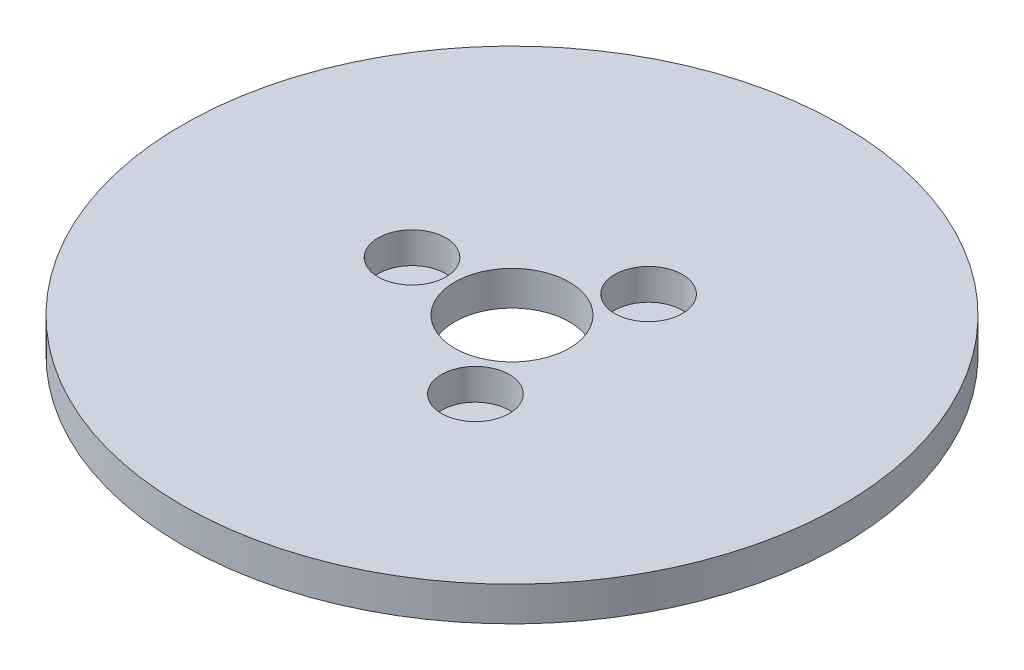
ISO-10303-21;
HEADER;
FILE_DESCRIPTION(('STEP AP214'),'2;1');
FILE_NAME('part.step','',(''),(''),'','','');
FILE_SCHEMA(('AUTOMOTIVE_DESIGN { 1 0 10303 214 1 1 1 1 }'));
ENDSEC;
DATA;
#1=APPLICATION_CONTEXT('core data for automotive mechanical design processes');
#2=APPLICATION_PROTOCOL_DEFINITION('international standard','automotive_design',2000,#1);
#3=PRODUCT_CONTEXT('',#1,'mechanical');
#4=PRODUCT('Part','Part','',(#3));
#5=PRODUCT_RELATED_PRODUCT_CATEGORY('part','',(#4));
#6=PRODUCT_DEFINITION_FORMATION('','',#4);
#7=PRODUCT_DEFINITION_CONTEXT('part definition',#1,'design');
#8=PRODUCT_DEFINITION('design','',#6,#7);
#9=PRODUCT_DEFINITION_SHAPE('','',#8);
#10=(LENGTH_UNIT() NAMED_UNIT(*) SI_UNIT(.MILLI.,.METRE.));
#11=(NAMED_UNIT(*) PLANE_ANGLE_UNIT() SI_UNIT($,.RADIAN.));
#12=(NAMED_UNIT(*) SI_UNIT($,.STERADIAN.) SOLID_ANGLE_UNIT());
#13=UNCERTAINTY_MEASURE_WITH_UNIT(LENGTH_MEASURE(1.E-05),#10,'distance_accuracy_value','');
#14=(GEOMETRIC_REPRESENTATION_CONTEXT(3) GLOBAL_UNCERTAINTY_ASSIGNED_CONTEXT((#13)) GLOBAL_UNIT_ASSIGNED_CONTEXT((#10,
#11,#12)) REPRESENTATION_CONTEXT('',''));
#15=CARTESIAN_POINT('',(0.,0.,0.));
#16=DIRECTION('',(0.,0.,1.));
#17=DIRECTION('',(1.,0.,0.));
#18=AXIS2_PLACEMENT_3D('',#15,#16,#17);
#19=CARTESIAN_POINT('',(0.,6.,0.));
#20=DIRECTION('',(0.,-1.,0.));
#21=DIRECTION('',(0.,0.,-1.));
#22=AXIS2_PLACEMENT_3D('',#19,#20,#21);
#23=CYLINDRICAL_SURFACE('',#22,57.5);
#24=CARTESIAN_POINT('',(0.,6.,0.));
#25=DIRECTION('',(0.,1.,0.));
#26=DIRECTION('',(0.,0.,1.));
#27=AXIS2_PLACEMENT_3D('',#24,#25,#26);
#28=CIRCLE('',#27,57.5);
#29=CARTESIAN_POINT('',(0.,6.,57.5));
#30=VERTEX_POINT('',#29);
#31=EDGE_CURVE('E10',#30,#30,#28,.T.);
#32=ORIENTED_EDGE('',*,*,#31,.F.);
#33=EDGE_LOOP('',(#32));
#34=FACE_BOUND('',#33,.T.);
#35=CARTESIAN_POINT('',(0.,0.,0.));
#36=DIRECTION('',(0.,1.,0.));
#37=DIRECTION('',(0.,0.,1.));
#38=AXIS2_PLACEMENT_3D('',#35,#36,#37);
#39=CIRCLE('',#38,57.5);
#40=CARTESIAN_POINT('',(0.,0.,57.5));
#41=VERTEX_POINT('',#40);
#42=EDGE_CURVE('E37',#41,#41,#39,.T.);
#43=ORIENTED_EDGE('',*,*,#42,.T.);
#44=EDGE_LOOP('',(#43));
#45=FACE_BOUND('',#44,.T.);
#46=ADVANCED_FACE('F40',(#34,#45),#23,.T.);
#47=CARTESIAN_POINT('',(0.,6.,0.));
#48=DIRECTION('',(0.,1.,0.));
#49=DIRECTION('',(0.,0.,1.));
#50=AXIS2_PLACEMENT_3D('',#47,#48,#49);
#51=PLANE('',#50);
#52=CARTESIAN_POINT('',(8.72151041746371,6.,15.1060991617882));
#53=DIRECTION('',(0.,1.,0.));
#54=DIRECTION('',(0.866025403784436,0.,-0.500000000000004));
#55=AXIS2_PLACEMENT_3D('',#52,#53,#54);
#56=CIRCLE('',#55,5.90704319477213);
#57=CARTESIAN_POINT('',(8.72151041746371,6.,21.0131423565604));
#58=VERTEX_POINT('',#57);
#59=EDGE_CURVE('E70',#58,#58,#56,.T.);
#60=ORIENTED_EDGE('',*,*,#59,.F.);
#61=EDGE_LOOP('',(#60));
#62=FACE_BOUND('',#61,.T.);
#63=CARTESIAN_POINT('',(8.7215104174635,6.,-15.1060991617884));
#64=DIRECTION('',(0.,1.,0.));
#65=DIRECTION('',(-0.866025403784443,0.,-0.499999999999992));
#66=AXIS2_PLACEMENT_3D('',#63,#64,#65);
#67=CIRCLE('',#66,5.90704319477213);
#68=CARTESIAN_POINT('',(8.7215104174635,6.,-9.19905596701622));
#69=VERTEX_POINT('',#68);
#70=EDGE_CURVE('E61',#69,#69,#67,.T.);
#71=ORIENTED_EDGE('',*,*,#70,.F.);
#72=EDGE_LOOP('',(#71));
#73=FACE_BOUND('',#72,.T.);
#74=CARTESIAN_POINT('',(-17.4430208349273,6.,0.));
#75=DIRECTION('',(0.,1.,0.));
#76=DIRECTION('',(0.,0.,1.));
#77=AXIS2_PLACEMENT_3D('',#74,#75,#76);
#78=CIRCLE('',#77,5.90704319477213);
#79=CARTESIAN_POINT('',(-17.4430208349273,6.,5.90704319477213));
#80=VERTEX_POINT('',#79);
#81=EDGE_CURVE('E54',#80,#80,#78,.T.);
#82=ORIENTED_EDGE('',*,*,#81,.F.);
#83=EDGE_LOOP('',(#82));
#84=FACE_BOUND('',#83,.T.);
#85=CARTESIAN_POINT('',(0.,6.,0.));
#86=DIRECTION('',(0.,1.,0.));
#87=DIRECTION('',(0.,0.,1.));
#88=AXIS2_PLACEMENT_3D('',#85,#86,#87);
#89=CIRCLE('',#88,10.);
#90=CARTESIAN_POINT('',(0.,6.,10.));
#91=VERTEX_POINT('',#90);
#92=EDGE_CURVE('E50',#91,#91,#89,.T.);
#93=ORIENTED_EDGE('',*,*,#92,.F.);
#94=EDGE_LOOP('',(#93));
#95=FACE_BOUND('',#94,.T.);
#96=ORIENTED_EDGE('',*,*,#31,.T.);
#97=EDGE_LOOP('',(#96));
#98=FACE_BOUND('',#97,.T.);
#99=ADVANCED_FACE('F85',(#62,#73,#84,#95,#98),#51,.T.);
#100=CARTESIAN_POINT('',(0.,0.,0.));
#101=DIRECTION('',(0.,1.,0.));
#102=DIRECTION('',(0.,0.,1.));
#103=AXIS2_PLACEMENT_3D('',#100,#101,#102);
#104=PLANE('',#103);
#105=CARTESIAN_POINT('',(0.,0.,0.));
#106=DIRECTION('',(0.,1.,0.));
#107=DIRECTION('',(0.,0.,1.));
#108=AXIS2_PLACEMENT_3D('',#105,#106,#107);
#109=CIRCLE('',#108,10.);
#110=CARTESIAN_POINT('',(0.,0.,10.));
#111=VERTEX_POINT('',#110);
#112=EDGE_CURVE('E47',#111,#111,#109,.T.);
#113=ORIENTED_EDGE('',*,*,#112,.T.);
#114=EDGE_LOOP('',(#113));
#115=FACE_BOUND('',#114,.T.);
#116=ORIENTED_EDGE('',*,*,#42,.F.);
#117=EDGE_LOOP('',(#116));
#118=FACE_BOUND('',#117,.T.);
#119=ADVANCED_FACE('F84',(#115,#118),#104,.F.);
#120=CARTESIAN_POINT('',(0.,6.,0.));
#121=DIRECTION('',(0.,-1.,0.));
#122=DIRECTION('',(0.,0.,-1.));
#123=AXIS2_PLACEMENT_3D('',#120,#121,#122);
#124=CYLINDRICAL_SURFACE('',#123,10.);
#125=ORIENTED_EDGE('',*,*,#92,.T.);
#126=EDGE_LOOP('',(#125));
#127=FACE_BOUND('',#126,.T.);
#128=ORIENTED_EDGE('',*,*,#112,.F.);
#129=EDGE_LOOP('',(#128));
#130=FACE_BOUND('',#129,.T.);
#131=ADVANCED_FACE('F91',(#127,#130),#124,.F.);
#132=CARTESIAN_POINT('',(-17.4430208349273,0.589212706234314,0.));
#133=DIRECTION('',(0.,1.,0.));
#134=DIRECTION('',(0.,0.,1.));
#135=AXIS2_PLACEMENT_3D('',#132,#133,#134);
#136=CYLINDRICAL_SURFACE('',#135,5.90704319477213);
#137=CARTESIAN_POINT('',(-17.4430208349273,0.589212706234314,0.));
#138=DIRECTION('',(0.,1.,0.));
#139=DIRECTION('',(0.,0.,1.));
#140=AXIS2_PLACEMENT_3D('',#137,#138,#139);
#141=CIRCLE('',#140,5.90704319477213);
#142=CARTESIAN_POINT('',(-17.4430208349273,0.589212706234314,5.90704319477213));
#143=VERTEX_POINT('',#142);
#144=EDGE_CURVE('E55',#143,#143,#141,.T.);
#145=CARTESIAN_POINT('',(-17.4430208349273,0.589212706234314,5.90704319477213));
#146=CARTESIAN_POINT('',(-17.4430208349273,0.645575073877706,5.90704319477213));
#147=CARTESIAN_POINT('',(-17.4430208349273,0.701937441521099,5.90704319477213));
#148=CARTESIAN_POINT('',(-17.4430208349273,0.814662176807884,5.90704319477213));
#149=CARTESIAN_POINT('',(-17.4430208349273,0.871024544451276,5.90704319477213));
#150=CARTESIAN_POINT('',(-17.4430208349273,0.983749279738062,5.90704319477213));
#151=CARTESIAN_POINT('',(-17.4430208349273,1.04011164738145,5.90704319477213));
#152=CARTESIAN_POINT('',(-17.4430208349273,1.15283638266824,5.90704319477213));
#153=CARTESIAN_POINT('',(-17.4430208349273,1.20919875031163,5.90704319477213));
#154=CARTESIAN_POINT('',(-17.4430208349273,1.32192348559842,5.90704319477213));
#155=CARTESIAN_POINT('',(-17.4430208349273,1.37828585324181,5.90704319477213));
#156=CARTESIAN_POINT('',(-17.4430208349273,1.49101058852859,5.90704319477213));
#157=CARTESIAN_POINT('',(-17.4430208349273,1.54737295617199,5.90704319477213));
#158=CARTESIAN_POINT('',(-17.4430208349273,1.66009769145877,5.90704319477213));
#159=CARTESIAN_POINT('',(-17.4430208349273,1.71646005910217,5.90704319477213));
#160=CARTESIAN_POINT('',(-17.4430208349273,1.82918479438895,5.90704319477213));
#161=CARTESIAN_POINT('',(-17.4430208349273,1.88554716203234,5.90704319477213));
#162=CARTESIAN_POINT('',(-17.4430208349273,1.99827189731913,5.90704319477213));
#163=CARTESIAN_POINT('',(-17.4430208349273,2.05463426496252,5.90704319477213));
#164=CARTESIAN_POINT('',(-17.4430208349273,2.16735900024931,5.90704319477213));
#165=CARTESIAN_POINT('',(-17.4430208349273,2.2237213678927,5.90704319477213));
#166=CARTESIAN_POINT('',(-17.4430208349273,2.33644610317948,5.90704319477213));
#167=CARTESIAN_POINT('',(-17.4430208349273,2.39280847082288,5.90704319477213));
#168=CARTESIAN_POINT('',(-17.4430208349273,2.50553320610966,5.90704319477213));
#169=CARTESIAN_POINT('',(-17.4430208349273,2.56189557375305,5.90704319477213));
#170=CARTESIAN_POINT('',(-17.4430208349273,2.67462030903984,5.90704319477213));
#171=CARTESIAN_POINT('',(-17.4430208349273,2.73098267668323,5.90704319477213));
#172=CARTESIAN_POINT('',(-17.4430208349273,2.84370741197002,5.90704319477213));
#173=CARTESIAN_POINT('',(-17.4430208349273,2.90006977961341,5.90704319477213));
#174=CARTESIAN_POINT('',(-17.4430208349273,3.01279451490019,5.90704319477213));
#175=CARTESIAN_POINT('',(-17.4430208349273,3.06915688254359,5.90704319477213));
#176=CARTESIAN_POINT('',(-17.4430208349273,3.18188161783037,5.90704319477213));
#177=CARTESIAN_POINT('',(-17.4430208349273,3.23824398547376,5.90704319477213));
#178=CARTESIAN_POINT('',(-17.4430208349273,3.35096872076055,5.90704319477213));
#179=CARTESIAN_POINT('',(-17.4430208349273,3.40733108840394,5.90704319477213));
#180=CARTESIAN_POINT('',(-17.4430208349273,3.52005582369073,5.90704319477213));
#181=CARTESIAN_POINT('',(-17.4430208349273,3.57641819133412,5.90704319477213));
#182=CARTESIAN_POINT('',(-17.4430208349273,3.6891429266209,5.90704319477213));
#183=CARTESIAN_POINT('',(-17.4430208349273,3.7455052942643,5.90704319477213));
#184=CARTESIAN_POINT('',(-17.4430208349273,3.85823002955108,5.90704319477213));
#185=CARTESIAN_POINT('',(-17.4430208349273,3.91459239719447,5.90704319477213));
#186=CARTESIAN_POINT('',(-17.4430208349273,4.02731713248126,5.90704319477213));
#187=CARTESIAN_POINT('',(-17.4430208349273,4.08367950012465,5.90704319477213));
#188=CARTESIAN_POINT('',(-17.4430208349273,4.19640423541144,5.90704319477213));
#189=CARTESIAN_POINT('',(-17.4430208349273,4.25276660305483,5.90704319477213));
#190=CARTESIAN_POINT('',(-17.4430208349273,4.36549133834162,5.90704319477213));
#191=CARTESIAN_POINT('',(-17.4430208349273,4.42185370598501,5.90704319477213));
#192=CARTESIAN_POINT('',(-17.4430208349273,4.53457844127179,5.90704319477213));
#193=CARTESIAN_POINT('',(-17.4430208349273,4.59094080891519,5.90704319477213));
#194=CARTESIAN_POINT('',(-17.4430208349273,4.70366554420197,5.90704319477213));
#195=CARTESIAN_POINT('',(-17.4430208349273,4.76002791184536,5.90704319477213));
#196=CARTESIAN_POINT('',(-17.4430208349273,4.87275264713215,5.90704319477213));
#197=CARTESIAN_POINT('',(-17.4430208349273,4.92911501477554,5.90704319477213));
#198=CARTESIAN_POINT('',(-17.4430208349273,5.04183975006233,5.90704319477213));
#199=CARTESIAN_POINT('',(-17.4430208349273,5.09820211770572,5.90704319477213));
#200=CARTESIAN_POINT('',(-17.4430208349273,5.2109268529925,5.90704319477213));
#201=CARTESIAN_POINT('',(-17.4430208349273,5.2672892206359,5.90704319477213));
#202=CARTESIAN_POINT('',(-17.4430208349273,5.38001395592268,5.90704319477213));
#203=CARTESIAN_POINT('',(-17.4430208349273,5.43637632356607,5.90704319477213));
#204=CARTESIAN_POINT('',(-17.4430208349273,5.54910105885286,5.90704319477213));
#205=CARTESIAN_POINT('',(-17.4430208349273,5.60546342649625,5.90704319477213));
#206=CARTESIAN_POINT('',(-17.4430208349273,5.71818816178304,5.90704319477213));
#207=CARTESIAN_POINT('',(-17.4430208349273,5.77455052942643,5.90704319477213));
#208=CARTESIAN_POINT('',(-17.4430208349273,5.88727526471321,5.90704319477213));
#209=CARTESIAN_POINT('',(-17.4430208349273,5.94363763235661,5.90704319477213));
#210=CARTESIAN_POINT('',(-17.4430208349273,6.,5.90704319477213));
#211=B_SPLINE_CURVE_WITH_KNOTS('',3,(#145,#146,#147,#148,#149,#150,#151,#152,#153,#154,#155,
#156,#157,#158,#159,#160,#161,#162,#163,#164,#165,#166,#167,#168,#169,#170,#171,#172,#173,#174,
#175,#176,#177,#178,#179,#180,#181,#182,#183,#184,#185,#186,#187,#188,#189,#190,#191,#192,#193,
#194,#195,#196,#197,#198,#199,#200,#201,#202,#203,#204,#205,#206,#207,#208,#209,#210),
.UNSPECIFIED.,.F.,.F.,(4,2,2,2,2,2,2,2,2,2,2,2,2,2,2,2,2,2,2,2,2,2,2,2,2,2,2,2,2,2,2,2,4),(0.,
0.169087102930178,0.338174205860355,0.507261308790533,0.676348411720711,0.845435514650889,
1.01452261758107,1.18360972051124,1.35269682344142,1.5217839263716,1.69087102930178,
1.85995813223195,2.02904523516213,2.19813233809231,2.36721944102249,2.53630654395267,
2.70539364688284,2.87448074981302,3.0435678527432,3.21265495567338,3.38174205860355,
3.55082916153373,3.71991626446391,3.88900336739409,4.05809047032427,4.22717757325444,
4.39626467618462,4.5653517791148,4.73443888204498,4.90352598497515,5.07261308790533,
5.24170019083551,5.41078729376569),.UNSPECIFIED.);
#212=EDGE_CURVE('BSEAM96',#143,#80,#211,.T.);
#213=ORIENTED_EDGE('',*,*,#144,.F.);
#214=ORIENTED_EDGE('',*,*,#81,.T.);
#215=ORIENTED_EDGE('',*,*,#212,.T.);
#216=ORIENTED_EDGE('',*,*,#212,.F.);
#217=EDGE_LOOP('',(#213,#215,#214,#216));
#218=FACE_BOUND('',#217,.T.);
#219=ADVANCED_FACE('F96',(#218),#136,.F.);
#220=CARTESIAN_POINT('',(-17.4430208349273,0.589212706234314,0.));
#221=DIRECTION('',(0.,1.,0.));
#222=DIRECTION('',(0.,0.,1.));
#223=AXIS2_PLACEMENT_3D('',#220,#221,#222);
#224=PLANE('',#223);
#225=ORIENTED_EDGE('',*,*,#144,.T.);
#226=EDGE_LOOP('',(#225));
#227=FACE_BOUND('',#226,.T.);
#228=ADVANCED_FACE('F127',(#227),#224,.T.);
#229=CARTESIAN_POINT('',(8.7215104174635,0.589212706234314,-15.1060991617884));
#230=DIRECTION('',(0.,1.,0.));
#231=DIRECTION('',(0.,0.,1.));
#232=AXIS2_PLACEMENT_3D('',#229,#230,#231);
#233=CYLINDRICAL_SURFACE('',#232,5.90704319477213);
#234=CARTESIAN_POINT('',(8.7215104174635,0.589212706234314,-15.1060991617884));
#235=DIRECTION('',(0.,1.,0.));
#236=DIRECTION('',(-0.866025403784443,0.,-0.499999999999992));
#237=AXIS2_PLACEMENT_3D('',#234,#235,#236);
#238=CIRCLE('',#237,5.90704319477213);
#239=CARTESIAN_POINT('',(8.7215104174635,0.589212706234314,-9.19905596701622));
#240=VERTEX_POINT('',#239);
#241=EDGE_CURVE('E63',#240,#240,#238,.T.);
#242=CARTESIAN_POINT('',(8.7215104174635,0.589212706234314,-9.19905596701622));
#243=CARTESIAN_POINT('',(8.7215104174635,0.645575073877706,-9.19905596701622));
#244=CARTESIAN_POINT('',(8.7215104174635,0.701937441521099,-9.19905596701622));
#245=CARTESIAN_POINT('',(8.7215104174635,0.814662176807884,-9.19905596701622));
#246=CARTESIAN_POINT('',(8.7215104174635,0.871024544451276,-9.19905596701622));
#247=CARTESIAN_POINT('',(8.7215104174635,0.983749279738062,-9.19905596701622));
#248=CARTESIAN_POINT('',(8.7215104174635,1.04011164738145,-9.19905596701622));
#249=CARTESIAN_POINT('',(8.7215104174635,1.15283638266824,-9.19905596701622));
#250=CARTESIAN_POINT('',(8.7215104174635,1.20919875031163,-9.19905596701622));
#251=CARTESIAN_POINT('',(8.7215104174635,1.32192348559842,-9.19905596701622));
#252=CARTESIAN_POINT('',(8.7215104174635,1.37828585324181,-9.19905596701622));
#253=CARTESIAN_POINT('',(8.7215104174635,1.49101058852859,-9.19905596701622));
#254=CARTESIAN_POINT('',(8.7215104174635,1.54737295617199,-9.19905596701622));
#255=CARTESIAN_POINT('',(8.7215104174635,1.66009769145877,-9.19905596701622));
#256=CARTESIAN_POINT('',(8.7215104174635,1.71646005910217,-9.19905596701622));
#257=CARTESIAN_POINT('',(8.7215104174635,1.82918479438895,-9.19905596701622));
#258=CARTESIAN_POINT('',(8.7215104174635,1.88554716203234,-9.19905596701622));
#259=CARTESIAN_POINT('',(8.7215104174635,1.99827189731913,-9.19905596701622));
#260=CARTESIAN_POINT('',(8.7215104174635,2.05463426496252,-9.19905596701622));
#261=CARTESIAN_POINT('',(8.7215104174635,2.16735900024931,-9.19905596701622));
#262=CARTESIAN_POINT('',(8.7215104174635,2.2237213678927,-9.19905596701622));
#263=CARTESIAN_POINT('',(8.7215104174635,2.33644610317948,-9.19905596701622));
#264=CARTESIAN_POINT('',(8.7215104174635,2.39280847082288,-9.19905596701622));
#265=CARTESIAN_POINT('',(8.7215104174635,2.50553320610966,-9.19905596701622));
#266=CARTESIAN_POINT('',(8.7215104174635,2.56189557375305,-9.19905596701622));
#267=CARTESIAN_POINT('',(8.7215104174635,2.67462030903984,-9.19905596701622));
#268=CARTESIAN_POINT('',(8.7215104174635,2.73098267668323,-9.19905596701622));
#269=CARTESIAN_POINT('',(8.7215104174635,2.84370741197002,-9.19905596701622));
#270=CARTESIAN_POINT('',(8.7215104174635,2.90006977961341,-9.19905596701622));
#271=CARTESIAN_POINT('',(8.7215104174635,3.01279451490019,-9.19905596701622));
#272=CARTESIAN_POINT('',(8.7215104174635,3.06915688254359,-9.19905596701622));
#273=CARTESIAN_POINT('',(8.7215104174635,3.18188161783037,-9.19905596701622));
#274=CARTESIAN_POINT('',(8.7215104174635,3.23824398547376,-9.19905596701622));
#275=CARTESIAN_POINT('',(8.7215104174635,3.35096872076055,-9.19905596701622));
#276=CARTESIAN_POINT('',(8.7215104174635,3.40733108840394,-9.19905596701622));
#277=CARTESIAN_POINT('',(8.7215104174635,3.52005582369073,-9.19905596701622));
#278=CARTESIAN_POINT('',(8.7215104174635,3.57641819133412,-9.19905596701622));
#279=CARTESIAN_POINT('',(8.7215104174635,3.6891429266209,-9.19905596701622));
#280=CARTESIAN_POINT('',(8.7215104174635,3.7455052942643,-9.19905596701622));
#281=CARTESIAN_POINT('',(8.7215104174635,3.85823002955108,-9.19905596701622));
#282=CARTESIAN_POINT('',(8.7215104174635,3.91459239719447,-9.19905596701622));
#283=CARTESIAN_POINT('',(8.7215104174635,4.02731713248126,-9.19905596701622));
#284=CARTESIAN_POINT('',(8.7215104174635,4.08367950012465,-9.19905596701622));
#285=CARTESIAN_POINT('',(8.7215104174635,4.19640423541144,-9.19905596701622));
#286=CARTESIAN_POINT('',(8.7215104174635,4.25276660305483,-9.19905596701622));
#287=CARTESIAN_POINT('',(8.7215104174635,4.36549133834162,-9.19905596701622));
#288=CARTESIAN_POINT('',(8.7215104174635,4.42185370598501,-9.19905596701622));
#289=CARTESIAN_POINT('',(8.7215104174635,4.53457844127179,-9.19905596701622));
#290=CARTESIAN_POINT('',(8.7215104174635,4.59094080891519,-9.19905596701622));
#291=CARTESIAN_POINT('',(8.7215104174635,4.70366554420197,-9.19905596701622));
#292=CARTESIAN_POINT('',(8.7215104174635,4.76002791184536,-9.19905596701622));
#293=CARTESIAN_POINT('',(8.7215104174635,4.87275264713215,-9.19905596701622));
#294=CARTESIAN_POINT('',(8.7215104174635,4.92911501477554,-9.19905596701622));
#295=CARTESIAN_POINT('',(8.7215104174635,5.04183975006233,-9.19905596701622));
#296=CARTESIAN_POINT('',(8.7215104174635,5.09820211770572,-9.19905596701622));
#297=CARTESIAN_POINT('',(8.7215104174635,5.2109268529925,-9.19905596701622));
#298=CARTESIAN_POINT('',(8.7215104174635,5.2672892206359,-9.19905596701622));
#299=CARTESIAN_POINT('',(8.7215104174635,5.38001395592268,-9.19905596701622));
#300=CARTESIAN_POINT('',(8.7215104174635,5.43637632356607,-9.19905596701622));
#301=CARTESIAN_POINT('',(8.7215104174635,5.54910105885286,-9.19905596701622));
#302=CARTESIAN_POINT('',(8.7215104174635,5.60546342649625,-9.19905596701622));
#303=CARTESIAN_POINT('',(8.7215104174635,5.71818816178304,-9.19905596701622));
#304=CARTESIAN_POINT('',(8.7215104174635,5.77455052942643,-9.19905596701622));
#305=CARTESIAN_POINT('',(8.7215104174635,5.88727526471321,-9.19905596701622));
#306=CARTESIAN_POINT('',(8.7215104174635,5.94363763235661,-9.19905596701622));
#307=CARTESIAN_POINT('',(8.7215104174635,6.,-9.19905596701622));
#308=B_SPLINE_CURVE_WITH_KNOTS('',3,(#242,#243,#244,#245,#246,#247,#248,#249,#250,#251,#252,
#253,#254,#255,#256,#257,#258,#259,#260,#261,#262,#263,#264,#265,#266,#267,#268,#269,#270,#271,
#272,#273,#274,#275,#276,#277,#278,#279,#280,#281,#282,#283,#284,#285,#286,#287,#288,#289,#290,
#291,#292,#293,#294,#295,#296,#297,#298,#299,#300,#301,#302,#303,#304,#305,#306,#307),
.UNSPECIFIED.,.F.,.F.,(4,2,2,2,2,2,2,2,2,2,2,2,2,2,2,2,2,2,2,2,2,2,2,2,2,2,2,2,2,2,2,2,4),(0.,
0.169087102930178,0.338174205860355,0.507261308790533,0.676348411720711,0.845435514650889,
1.01452261758107,1.18360972051124,1.35269682344142,1.5217839263716,1.69087102930178,
1.85995813223195,2.02904523516213,2.19813233809231,2.36721944102249,2.53630654395267,
2.70539364688284,2.87448074981302,3.0435678527432,3.21265495567338,3.38174205860355,
3.55082916153373,3.71991626446391,3.88900336739409,4.05809047032427,4.22717757325444,
4.39626467618462,4.5653517791148,4.73443888204498,4.90352598497515,5.07261308790533,
5.24170019083551,5.41078729376569),.UNSPECIFIED.);
#309=EDGE_CURVE('BSEAM133',#240,#69,#308,.T.);
#310=ORIENTED_EDGE('',*,*,#241,.F.);
#311=ORIENTED_EDGE('',*,*,#70,.T.);
#312=ORIENTED_EDGE('',*,*,#309,.T.);
#313=ORIENTED_EDGE('',*,*,#309,.F.);
#314=EDGE_LOOP('',(#310,#312,#311,#313));
#315=FACE_BOUND('',#314,.T.);
#316=ADVANCED_FACE('F133',(#315),#233,.F.);
#317=CARTESIAN_POINT('',(8.7215104174635,0.589212706234314,-15.1060991617884));
#318=DIRECTION('',(0.,1.,0.));
#319=DIRECTION('',(-0.866025403784443,0.,-0.499999999999992));
#320=AXIS2_PLACEMENT_3D('',#317,#318,#319);
#321=PLANE('',#320);
#322=ORIENTED_EDGE('',*,*,#241,.T.);
#323=EDGE_LOOP('',(#322));
#324=FACE_BOUND('',#323,.T.);
#325=ADVANCED_FACE('F77',(#324),#321,.T.);
#326=CARTESIAN_POINT('',(8.72151041746371,0.589212706234314,15.1060991617882));
#327=DIRECTION('',(0.,1.,0.));
#328=DIRECTION('',(0.,0.,1.));
#329=AXIS2_PLACEMENT_3D('',#326,#327,#328);
#330=CYLINDRICAL_SURFACE('',#329,5.90704319477213);
#331=CARTESIAN_POINT('',(8.72151041746371,0.589212706234314,15.1060991617882));
#332=DIRECTION('',(0.,1.,0.));
#333=DIRECTION('',(0.866025403784436,0.,-0.500000000000004));
#334=AXIS2_PLACEMENT_3D('',#331,#332,#333);
#335=CIRCLE('',#334,5.90704319477213);
#336=CARTESIAN_POINT('',(8.72151041746371,0.589212706234314,21.0131423565604));
#337=VERTEX_POINT('',#336);
#338=EDGE_CURVE('E59',#337,#337,#335,.T.);
#339=CARTESIAN_POINT('',(8.72151041746371,0.589212706234314,21.0131423565604));
#340=CARTESIAN_POINT('',(8.72151041746371,0.645575073877706,21.0131423565604));
#341=CARTESIAN_POINT('',(8.72151041746371,0.701937441521099,21.0131423565604));
#342=CARTESIAN_POINT('',(8.72151041746371,0.814662176807884,21.0131423565604));
#343=CARTESIAN_POINT('',(8.72151041746371,0.871024544451276,21.0131423565604));
#344=CARTESIAN_POINT('',(8.72151041746371,0.983749279738062,21.0131423565604));
#345=CARTESIAN_POINT('',(8.72151041746371,1.04011164738145,21.0131423565604));
#346=CARTESIAN_POINT('',(8.72151041746371,1.15283638266824,21.0131423565604));
#347=CARTESIAN_POINT('',(8.72151041746371,1.20919875031163,21.0131423565604));
#348=CARTESIAN_POINT('',(8.72151041746371,1.32192348559842,21.0131423565604));
#349=CARTESIAN_POINT('',(8.72151041746371,1.37828585324181,21.0131423565604));
#350=CARTESIAN_POINT('',(8.72151041746371,1.49101058852859,21.0131423565604));
#351=CARTESIAN_POINT('',(8.72151041746371,1.54737295617199,21.0131423565604));
#352=CARTESIAN_POINT('',(8.72151041746371,1.66009769145877,21.0131423565604));
#353=CARTESIAN_POINT('',(8.72151041746371,1.71646005910217,21.0131423565604));
#354=CARTESIAN_POINT('',(8.72151041746371,1.82918479438895,21.0131423565604));
#355=CARTESIAN_POINT('',(8.72151041746371,1.88554716203234,21.0131423565604));
#356=CARTESIAN_POINT('',(8.72151041746371,1.99827189731913,21.0131423565604));
#357=CARTESIAN_POINT('',(8.72151041746371,2.05463426496252,21.0131423565604));
#358=CARTESIAN_POINT('',(8.72151041746371,2.16735900024931,21.0131423565604));
#359=CARTESIAN_POINT('',(8.72151041746371,2.2237213678927,21.0131423565604));
#360=CARTESIAN_POINT('',(8.72151041746371,2.33644610317948,21.0131423565604));
#361=CARTESIAN_POINT('',(8.72151041746371,2.39280847082288,21.0131423565604));
#362=CARTESIAN_POINT('',(8.72151041746371,2.50553320610966,21.0131423565604));
#363=CARTESIAN_POINT('',(8.72151041746371,2.56189557375305,21.0131423565604));
#364=CARTESIAN_POINT('',(8.72151041746371,2.67462030903984,21.0131423565604));
#365=CARTESIAN_POINT('',(8.72151041746371,2.73098267668323,21.0131423565604));
#366=CARTESIAN_POINT('',(8.72151041746371,2.84370741197002,21.0131423565604));
#367=CARTESIAN_POINT('',(8.72151041746371,2.90006977961341,21.0131423565604));
#368=CARTESIAN_POINT('',(8.72151041746371,3.01279451490019,21.0131423565604));
#369=CARTESIAN_POINT('',(8.72151041746371,3.06915688254359,21.0131423565604));
#370=CARTESIAN_POINT('',(8.72151041746371,3.18188161783037,21.0131423565604));
#371=CARTESIAN_POINT('',(8.72151041746371,3.23824398547376,21.0131423565604));
#372=CARTESIAN_POINT('',(8.72151041746371,3.35096872076055,21.0131423565604));
#373=CARTESIAN_POINT('',(8.72151041746371,3.40733108840394,21.0131423565604));
#374=CARTESIAN_POINT('',(8.72151041746371,3.52005582369073,21.0131423565604));
#375=CARTESIAN_POINT('',(8.72151041746371,3.57641819133412,21.0131423565604));
#376=CARTESIAN_POINT('',(8.72151041746371,3.6891429266209,21.0131423565604));
#377=CARTESIAN_POINT('',(8.72151041746371,3.7455052942643,21.0131423565604));
#378=CARTESIAN_POINT('',(8.72151041746371,3.85823002955108,21.0131423565604));
#379=CARTESIAN_POINT('',(8.72151041746371,3.91459239719447,21.0131423565604));
#380=CARTESIAN_POINT('',(8.72151041746371,4.02731713248126,21.0131423565604));
#381=CARTESIAN_POINT('',(8.72151041746371,4.08367950012465,21.0131423565604));
#382=CARTESIAN_POINT('',(8.72151041746371,4.19640423541144,21.0131423565604));
#383=CARTESIAN_POINT('',(8.72151041746371,4.25276660305483,21.0131423565604));
#384=CARTESIAN_POINT('',(8.72151041746371,4.36549133834162,21.0131423565604));
#385=CARTESIAN_POINT('',(8.72151041746371,4.42185370598501,21.0131423565604));
#386=CARTESIAN_POINT('',(8.72151041746371,4.53457844127179,21.0131423565604));
#387=CARTESIAN_POINT('',(8.72151041746371,4.59094080891519,21.0131423565604));
#388=CARTESIAN_POINT('',(8.72151041746371,4.70366554420197,21.0131423565604));
#389=CARTESIAN_POINT('',(8.72151041746371,4.76002791184536,21.0131423565604));
#390=CARTESIAN_POINT('',(8.72151041746371,4.87275264713215,21.0131423565604));
#391=CARTESIAN_POINT('',(8.72151041746371,4.92911501477554,21.0131423565604));
#392=CARTESIAN_POINT('',(8.72151041746371,5.04183975006233,21.0131423565604));
#393=CARTESIAN_POINT('',(8.72151041746371,5.09820211770572,21.0131423565604));
#394=CARTESIAN_POINT('',(8.72151041746371,5.2109268529925,21.0131423565604));
#395=CARTESIAN_POINT('',(8.72151041746371,5.2672892206359,21.0131423565604));
#396=CARTESIAN_POINT('',(8.72151041746371,5.38001395592268,21.0131423565604));
#397=CARTESIAN_POINT('',(8.72151041746371,5.43637632356607,21.0131423565604));
#398=CARTESIAN_POINT('',(8.72151041746371,5.54910105885286,21.0131423565604));
#399=CARTESIAN_POINT('',(8.72151041746371,5.60546342649625,21.0131423565604));
#400=CARTESIAN_POINT('',(8.72151041746371,5.71818816178304,21.0131423565604));
#401=CARTESIAN_POINT('',(8.72151041746371,5.77455052942643,21.0131423565604));
#402=CARTESIAN_POINT('',(8.72151041746371,5.88727526471321,21.0131423565604));
#403=CARTESIAN_POINT('',(8.72151041746371,5.94363763235661,21.0131423565604));
#404=CARTESIAN_POINT('',(8.72151041746371,6.,21.0131423565604));
#405=B_SPLINE_CURVE_WITH_KNOTS('',3,(#339,#340,#341,#342,#343,#344,#345,#346,#347,#348,#349,
#350,#351,#352,#353,#354,#355,#356,#357,#358,#359,#360,#361,#362,#363,#364,#365,#366,#367,#368,
#369,#370,#371,#372,#373,#374,#375,#376,#377,#378,#379,#380,#381,#382,#383,#384,#385,#386,#387,
#388,#389,#390,#391,#392,#393,#394,#395,#396,#397,#398,#399,#400,#401,#402,#403,#404),
.UNSPECIFIED.,.F.,.F.,(4,2,2,2,2,2,2,2,2,2,2,2,2,2,2,2,2,2,2,2,2,2,2,2,2,2,2,2,2,2,2,2,4),(0.,
0.169087102930178,0.338174205860355,0.507261308790533,0.676348411720711,0.845435514650889,
1.01452261758107,1.18360972051124,1.35269682344142,1.5217839263716,1.69087102930178,
1.85995813223195,2.02904523516213,2.19813233809231,2.36721944102249,2.53630654395267,
2.70539364688284,2.87448074981302,3.0435678527432,3.21265495567338,3.38174205860355,
3.55082916153373,3.71991626446391,3.88900336739409,4.05809047032427,4.22717757325444,
4.39626467618462,4.5653517791148,4.73443888204498,4.90352598497515,5.07261308790533,
5.24170019083551,5.41078729376569),.UNSPECIFIED.);
#406=EDGE_CURVE('BSEAM73',#337,#58,#405,.T.);
#407=ORIENTED_EDGE('',*,*,#338,.F.);
#408=ORIENTED_EDGE('',*,*,#59,.T.);
#409=ORIENTED_EDGE('',*,*,#406,.T.);
#410=ORIENTED_EDGE('',*,*,#406,.F.);
#411=EDGE_LOOP('',(#407,#409,#408,#410));
#412=FACE_BOUND('',#411,.T.);
#413=ADVANCED_FACE('F73',(#412),#330,.F.);
#414=CARTESIAN_POINT('',(8.72151041746371,0.589212706234314,15.1060991617882));
#415=DIRECTION('',(0.,1.,0.));
#416=DIRECTION('',(0.866025403784436,0.,-0.500000000000004));
#417=AXIS2_PLACEMENT_3D('',#414,#415,#416);
#418=PLANE('',#417);
#419=ORIENTED_EDGE('',*,*,#338,.T.);
#420=EDGE_LOOP('',(#419));
#421=FACE_BOUND('',#420,.T.);
#422=ADVANCED_FACE('F71',(#421),#418,.T.);
#423=CLOSED_SHELL('',(#46,#99,#119,#131,#219,#228,#316,#325,#413,#422));
#424=MANIFOLD_SOLID_BREP('B2',#423);
#425=ADVANCED_BREP_SHAPE_REPRESENTATION('',(#18,#424),#14);
#426=SHAPE_DEFINITION_REPRESENTATION(#9,#425);
ENDSEC;
END-ISO-10303-21;
